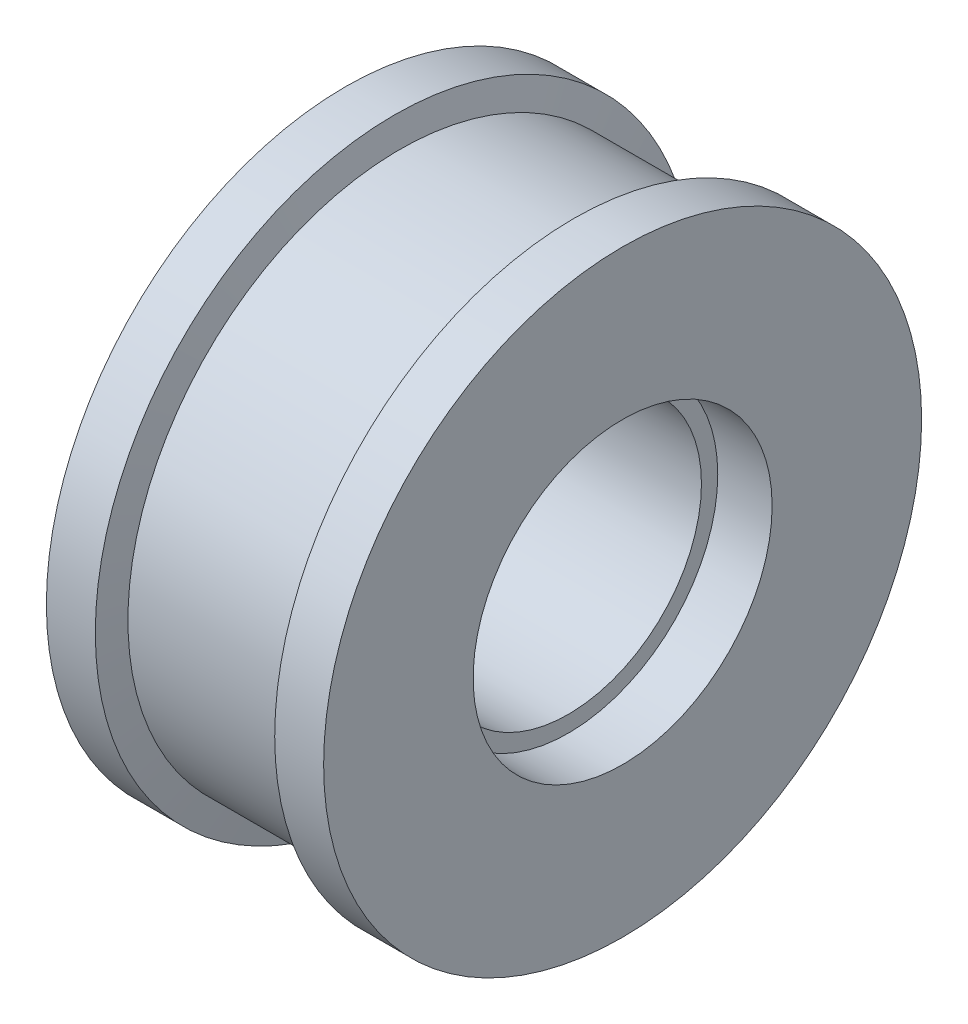
ISO-10303-21;
HEADER;
FILE_DESCRIPTION(('STEP AP214'),'2;1');
FILE_NAME('part.step','',(''),(''),'','','');
FILE_SCHEMA(('AUTOMOTIVE_DESIGN { 1 0 10303 214 1 1 1 1 }'));
ENDSEC;
DATA;
#1=APPLICATION_CONTEXT('core data for automotive mechanical design processes');
#2=APPLICATION_PROTOCOL_DEFINITION('international standard','automotive_design',2000,#1);
#3=PRODUCT_CONTEXT('',#1,'mechanical');
#4=PRODUCT('Part','Part','',(#3));
#5=PRODUCT_RELATED_PRODUCT_CATEGORY('part','',(#4));
#6=PRODUCT_DEFINITION_FORMATION('','',#4);
#7=PRODUCT_DEFINITION_CONTEXT('part definition',#1,'design');
#8=PRODUCT_DEFINITION('design','',#6,#7);
#9=PRODUCT_DEFINITION_SHAPE('','',#8);
#10=(LENGTH_UNIT() NAMED_UNIT(*) SI_UNIT(.MILLI.,.METRE.));
#11=(NAMED_UNIT(*) PLANE_ANGLE_UNIT() SI_UNIT($,.RADIAN.));
#12=(NAMED_UNIT(*) SI_UNIT($,.STERADIAN.) SOLID_ANGLE_UNIT());
#13=UNCERTAINTY_MEASURE_WITH_UNIT(LENGTH_MEASURE(1.E-05),#10,'distance_accuracy_value','');
#14=(GEOMETRIC_REPRESENTATION_CONTEXT(3) GLOBAL_UNCERTAINTY_ASSIGNED_CONTEXT((#13)) GLOBAL_UNIT_ASSIGNED_CONTEXT((#10,
#11,#12)) REPRESENTATION_CONTEXT('',''));
#15=CARTESIAN_POINT('',(0.,0.,0.));
#16=DIRECTION('',(0.,0.,1.));
#17=DIRECTION('',(1.,0.,0.));
#18=AXIS2_PLACEMENT_3D('',#15,#16,#17);
#19=CARTESIAN_POINT('',(51.,0.,0.));
#20=DIRECTION('',(1.,0.,0.));
#21=DIRECTION('',(0.,0.,-1.));
#22=AXIS2_PLACEMENT_3D('',#19,#20,#21);
#23=CYLINDRICAL_SURFACE('',#22,54.9999999999993);
#24=CARTESIAN_POINT('',(9.,0.,0.));
#25=DIRECTION('',(1.,0.,0.));
#26=DIRECTION('',(0.,0.,-1.));
#27=AXIS2_PLACEMENT_3D('',#24,#25,#26);
#28=CIRCLE('',#27,54.9999999999997);
#29=CARTESIAN_POINT('',(9.,0.,-54.9999999999997));
#30=VERTEX_POINT('',#29);
#31=EDGE_CURVE('E10',#30,#30,#28,.T.);
#32=ORIENTED_EDGE('',*,*,#31,.F.);
#33=EDGE_LOOP('',(#32));
#34=FACE_BOUND('',#33,.T.);
#35=CARTESIAN_POINT('',(0.,0.,0.));
#36=DIRECTION('',(1.,0.,0.));
#37=DIRECTION('',(0.,0.,-1.));
#38=AXIS2_PLACEMENT_3D('',#35,#36,#37);
#39=CIRCLE('',#38,54.9999999999988);
#40=CARTESIAN_POINT('',(0.,0.,-54.9999999999988));
#41=VERTEX_POINT('',#40);
#42=EDGE_CURVE('E72',#41,#41,#39,.T.);
#43=ORIENTED_EDGE('',*,*,#42,.T.);
#44=EDGE_LOOP('',(#43));
#45=FACE_BOUND('',#44,.T.);
#46=ADVANCED_FACE('F32',(#34,#45),#23,.T.);
#47=CARTESIAN_POINT('',(9.,0.,0.));
#48=DIRECTION('',(-1.,0.,0.));
#49=DIRECTION('',(0.,0.,1.));
#50=AXIS2_PLACEMENT_3D('',#47,#48,#49);
#51=CONICAL_SURFACE('',#50,54.9999999999997,1.37340076694505);
#52=CARTESIAN_POINT('',(10.,0.,0.));
#53=DIRECTION('',(1.,0.,0.));
#54=DIRECTION('',(0.,0.,-1.));
#55=AXIS2_PLACEMENT_3D('',#52,#53,#54);
#56=CIRCLE('',#55,49.9999999999989);
#57=CARTESIAN_POINT('',(10.,0.,-49.9999999999989));
#58=VERTEX_POINT('',#57);
#59=EDGE_CURVE('E38',#58,#58,#56,.T.);
#60=ORIENTED_EDGE('',*,*,#59,.F.);
#61=EDGE_LOOP('',(#60));
#62=FACE_BOUND('',#61,.T.);
#63=ORIENTED_EDGE('',*,*,#31,.T.);
#64=EDGE_LOOP('',(#63));
#65=FACE_BOUND('',#64,.T.);
#66=ADVANCED_FACE('F133',(#62,#65),#51,.T.);
#67=CARTESIAN_POINT('',(51.,0.,0.));
#68=DIRECTION('',(1.,0.,0.));
#69=DIRECTION('',(0.,0.,-1.));
#70=AXIS2_PLACEMENT_3D('',#67,#68,#69);
#71=CYLINDRICAL_SURFACE('',#70,49.9999999999989);
#72=CARTESIAN_POINT('',(41.,0.,0.));
#73=DIRECTION('',(1.,0.,0.));
#74=DIRECTION('',(0.,0.,-1.));
#75=AXIS2_PLACEMENT_3D('',#72,#73,#74);
#76=CIRCLE('',#75,49.9999999999989);
#77=CARTESIAN_POINT('',(41.,0.,-49.9999999999989));
#78=VERTEX_POINT('',#77);
#79=EDGE_CURVE('E42',#78,#78,#76,.T.);
#80=ORIENTED_EDGE('',*,*,#79,.F.);
#81=EDGE_LOOP('',(#80));
#82=FACE_BOUND('',#81,.T.);
#83=ORIENTED_EDGE('',*,*,#59,.T.);
#84=EDGE_LOOP('',(#83));
#85=FACE_BOUND('',#84,.T.);
#86=ADVANCED_FACE('F128',(#82,#85),#71,.T.);
#87=CARTESIAN_POINT('',(41.,0.,0.));
#88=DIRECTION('',(1.,0.,0.));
#89=DIRECTION('',(0.,0.,-1.));
#90=AXIS2_PLACEMENT_3D('',#87,#88,#89);
#91=CONICAL_SURFACE('',#90,49.9999999999989,1.37340076694501);
#92=CARTESIAN_POINT('',(42.,0.,0.));
#93=DIRECTION('',(1.,0.,0.));
#94=DIRECTION('',(0.,0.,-1.));
#95=AXIS2_PLACEMENT_3D('',#92,#93,#94);
#96=CIRCLE('',#95,54.9999999999988);
#97=CARTESIAN_POINT('',(42.,0.,-54.9999999999988));
#98=VERTEX_POINT('',#97);
#99=EDGE_CURVE('E46',#98,#98,#96,.T.);
#100=ORIENTED_EDGE('',*,*,#99,.F.);
#101=EDGE_LOOP('',(#100));
#102=FACE_BOUND('',#101,.T.);
#103=ORIENTED_EDGE('',*,*,#79,.T.);
#104=EDGE_LOOP('',(#103));
#105=FACE_BOUND('',#104,.T.);
#106=ADVANCED_FACE('F122',(#102,#105),#91,.T.);
#107=CARTESIAN_POINT('',(51.,0.,0.));
#108=DIRECTION('',(1.,0.,0.));
#109=DIRECTION('',(0.,0.,-1.));
#110=AXIS2_PLACEMENT_3D('',#107,#108,#109);
#111=CYLINDRICAL_SURFACE('',#110,54.9999999999988);
#112=CARTESIAN_POINT('',(51.,0.,0.));
#113=DIRECTION('',(1.,0.,0.));
#114=DIRECTION('',(0.,0.,-1.));
#115=AXIS2_PLACEMENT_3D('',#112,#113,#114);
#116=CIRCLE('',#115,54.9999999999988);
#117=CARTESIAN_POINT('',(51.,0.,-54.9999999999988));
#118=VERTEX_POINT('',#117);
#119=EDGE_CURVE('E51',#118,#118,#116,.T.);
#120=ORIENTED_EDGE('',*,*,#119,.F.);
#121=EDGE_LOOP('',(#120));
#122=FACE_BOUND('',#121,.T.);
#123=ORIENTED_EDGE('',*,*,#99,.T.);
#124=EDGE_LOOP('',(#123));
#125=FACE_BOUND('',#124,.T.);
#126=ADVANCED_FACE('F116',(#122,#125),#111,.T.);
#127=CARTESIAN_POINT('',(51.,0.,54.9999999999988));
#128=DIRECTION('',(-1.,0.,0.));
#129=DIRECTION('',(0.,0.,1.));
#130=AXIS2_PLACEMENT_3D('',#127,#128,#129);
#131=PLANE('',#130);
#132=CARTESIAN_POINT('',(51.,0.,0.));
#133=DIRECTION('',(1.,0.,0.));
#134=DIRECTION('',(0.,0.,-1.));
#135=AXIS2_PLACEMENT_3D('',#132,#133,#134);
#136=CIRCLE('',#135,27.4999999999999);
#137=CARTESIAN_POINT('',(51.,0.,-27.4999999999999));
#138=VERTEX_POINT('',#137);
#139=EDGE_CURVE('E54',#138,#138,#136,.T.);
#140=ORIENTED_EDGE('',*,*,#139,.F.);
#141=EDGE_LOOP('',(#140));
#142=FACE_BOUND('',#141,.T.);
#143=ORIENTED_EDGE('',*,*,#119,.T.);
#144=EDGE_LOOP('',(#143));
#145=FACE_BOUND('',#144,.T.);
#146=ADVANCED_FACE('F110',(#142,#145),#131,.F.);
#147=CARTESIAN_POINT('',(51.,0.,0.));
#148=DIRECTION('',(1.,0.,0.));
#149=DIRECTION('',(0.,0.,-1.));
#150=AXIS2_PLACEMENT_3D('',#147,#148,#149);
#151=CYLINDRICAL_SURFACE('',#150,27.5000000000003);
#152=CARTESIAN_POINT('',(41.0000000000002,0.,0.));
#153=DIRECTION('',(1.,0.,0.));
#154=DIRECTION('',(0.,0.,-1.));
#155=AXIS2_PLACEMENT_3D('',#152,#153,#154);
#156=CIRCLE('',#155,27.5000000000007);
#157=CARTESIAN_POINT('',(41.0000000000002,0.,-27.5000000000007));
#158=VERTEX_POINT('',#157);
#159=EDGE_CURVE('E57',#158,#158,#156,.T.);
#160=ORIENTED_EDGE('',*,*,#159,.F.);
#161=EDGE_LOOP('',(#160));
#162=FACE_BOUND('',#161,.T.);
#163=ORIENTED_EDGE('',*,*,#139,.T.);
#164=EDGE_LOOP('',(#163));
#165=FACE_BOUND('',#164,.T.);
#166=ADVANCED_FACE('F104',(#162,#165),#151,.F.);
#167=CARTESIAN_POINT('',(41.0000000000002,0.,27.5000000000007));
#168=DIRECTION('',(-1.,0.,0.));
#169=DIRECTION('',(0.,0.,1.));
#170=AXIS2_PLACEMENT_3D('',#167,#168,#169);
#171=PLANE('',#170);
#172=CARTESIAN_POINT('',(41.0000000000002,0.,0.));
#173=DIRECTION('',(1.,0.,0.));
#174=DIRECTION('',(0.,0.,-1.));
#175=AXIS2_PLACEMENT_3D('',#172,#173,#174);
#176=CIRCLE('',#175,24.4999999999997);
#177=CARTESIAN_POINT('',(41.0000000000002,0.,-24.4999999999997));
#178=VERTEX_POINT('',#177);
#179=EDGE_CURVE('E60',#178,#178,#176,.T.);
#180=ORIENTED_EDGE('',*,*,#179,.F.);
#181=EDGE_LOOP('',(#180));
#182=FACE_BOUND('',#181,.T.);
#183=ORIENTED_EDGE('',*,*,#159,.T.);
#184=EDGE_LOOP('',(#183));
#185=FACE_BOUND('',#184,.T.);
#186=ADVANCED_FACE('F98',(#182,#185),#171,.F.);
#187=CARTESIAN_POINT('',(51.,0.,0.));
#188=DIRECTION('',(1.,0.,0.));
#189=DIRECTION('',(0.,0.,-1.));
#190=AXIS2_PLACEMENT_3D('',#187,#188,#189);
#191=CYLINDRICAL_SURFACE('',#190,24.4999999999997);
#192=CARTESIAN_POINT('',(9.99999999999979,0.,0.));
#193=DIRECTION('',(1.,0.,0.));
#194=DIRECTION('',(0.,0.,-1.));
#195=AXIS2_PLACEMENT_3D('',#192,#193,#194);
#196=CIRCLE('',#195,24.4999999999997);
#197=CARTESIAN_POINT('',(9.99999999999979,0.,-24.4999999999997));
#198=VERTEX_POINT('',#197);
#199=EDGE_CURVE('E63',#198,#198,#196,.T.);
#200=ORIENTED_EDGE('',*,*,#199,.F.);
#201=EDGE_LOOP('',(#200));
#202=FACE_BOUND('',#201,.T.);
#203=ORIENTED_EDGE('',*,*,#179,.T.);
#204=EDGE_LOOP('',(#203));
#205=FACE_BOUND('',#204,.T.);
#206=ADVANCED_FACE('F92',(#202,#205),#191,.F.);
#207=CARTESIAN_POINT('',(9.99999999999979,0.,24.4999999999997));
#208=DIRECTION('',(1.,0.,0.));
#209=DIRECTION('',(0.,0.,-1.));
#210=AXIS2_PLACEMENT_3D('',#207,#208,#209);
#211=PLANE('',#210);
#212=CARTESIAN_POINT('',(9.99999999999979,0.,0.));
#213=DIRECTION('',(1.,0.,0.));
#214=DIRECTION('',(0.,0.,-1.));
#215=AXIS2_PLACEMENT_3D('',#212,#213,#214);
#216=CIRCLE('',#215,27.4999999999999);
#217=CARTESIAN_POINT('',(9.99999999999979,0.,-27.4999999999999));
#218=VERTEX_POINT('',#217);
#219=EDGE_CURVE('E66',#218,#218,#216,.T.);
#220=ORIENTED_EDGE('',*,*,#219,.F.);
#221=EDGE_LOOP('',(#220));
#222=FACE_BOUND('',#221,.T.);
#223=ORIENTED_EDGE('',*,*,#199,.T.);
#224=EDGE_LOOP('',(#223));
#225=FACE_BOUND('',#224,.T.);
#226=ADVANCED_FACE('F86',(#222,#225),#211,.F.);
#227=CARTESIAN_POINT('',(51.,0.,0.));
#228=DIRECTION('',(1.,0.,0.));
#229=DIRECTION('',(0.,0.,-1.));
#230=AXIS2_PLACEMENT_3D('',#227,#228,#229);
#231=CYLINDRICAL_SURFACE('',#230,27.4999999999999);
#232=CARTESIAN_POINT('',(0.,0.,0.));
#233=DIRECTION('',(1.,0.,0.));
#234=DIRECTION('',(0.,0.,-1.));
#235=AXIS2_PLACEMENT_3D('',#232,#233,#234);
#236=CIRCLE('',#235,27.4999999999999);
#237=CARTESIAN_POINT('',(0.,0.,-27.4999999999999));
#238=VERTEX_POINT('',#237);
#239=EDGE_CURVE('E69',#238,#238,#236,.T.);
#240=ORIENTED_EDGE('',*,*,#239,.F.);
#241=EDGE_LOOP('',(#240));
#242=FACE_BOUND('',#241,.T.);
#243=ORIENTED_EDGE('',*,*,#219,.T.);
#244=EDGE_LOOP('',(#243));
#245=FACE_BOUND('',#244,.T.);
#246=ADVANCED_FACE('F80',(#242,#245),#231,.F.);
#247=CARTESIAN_POINT('',(0.,0.,27.4999999999999));
#248=DIRECTION('',(1.,0.,0.));
#249=DIRECTION('',(0.,0.,-1.));
#250=AXIS2_PLACEMENT_3D('',#247,#248,#249);
#251=PLANE('',#250);
#252=ORIENTED_EDGE('',*,*,#42,.F.);
#253=EDGE_LOOP('',(#252));
#254=FACE_BOUND('',#253,.T.);
#255=ORIENTED_EDGE('',*,*,#239,.T.);
#256=EDGE_LOOP('',(#255));
#257=FACE_BOUND('',#256,.T.);
#258=ADVANCED_FACE('F77',(#254,#257),#251,.F.);
#259=CLOSED_SHELL('',(#46,#66,#86,#106,#126,#146,#166,#186,#206,#226,#246,#258));
#260=MANIFOLD_SOLID_BREP('B2',#259);
#261=ADVANCED_BREP_SHAPE_REPRESENTATION('',(#18,#260),#14);
#262=SHAPE_DEFINITION_REPRESENTATION(#9,#261);
ENDSEC;
END-ISO-10303-21;
